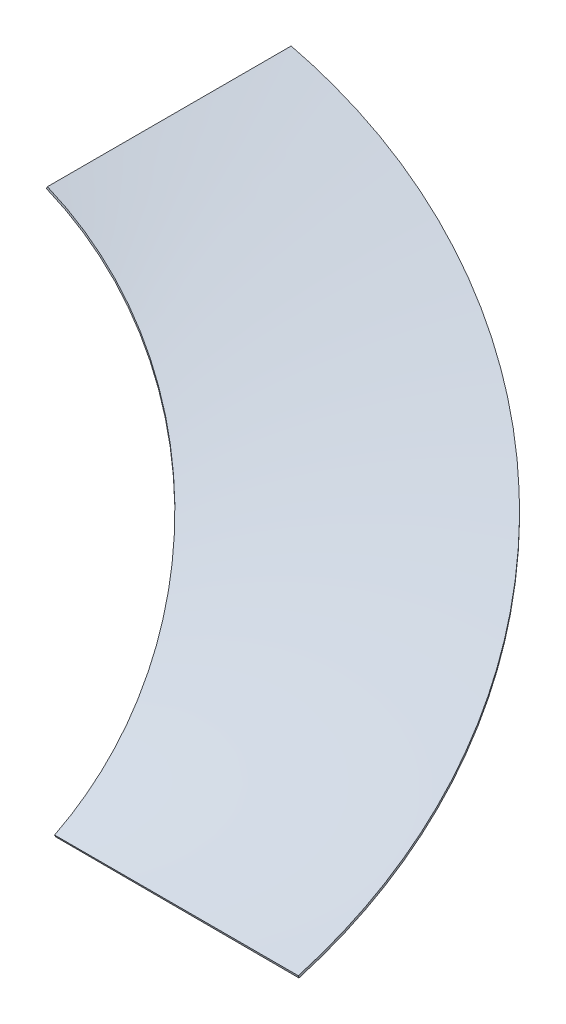
ISO-10303-21;
HEADER;
FILE_DESCRIPTION(('STEP AP214'),'2;1');
FILE_NAME('part.step','',(''),(''),'','','');
FILE_SCHEMA(('AUTOMOTIVE_DESIGN { 1 0 10303 214 1 1 1 1 }'));
ENDSEC;
DATA;
#1=APPLICATION_CONTEXT('core data for automotive mechanical design processes');
#2=APPLICATION_PROTOCOL_DEFINITION('international standard','automotive_design',2000,#1);
#3=PRODUCT_CONTEXT('',#1,'mechanical');
#4=PRODUCT('Part','Part','',(#3));
#5=PRODUCT_RELATED_PRODUCT_CATEGORY('part','',(#4));
#6=PRODUCT_DEFINITION_FORMATION('','',#4);
#7=PRODUCT_DEFINITION_CONTEXT('part definition',#1,'design');
#8=PRODUCT_DEFINITION('design','',#6,#7);
#9=PRODUCT_DEFINITION_SHAPE('','',#8);
#10=(LENGTH_UNIT() NAMED_UNIT(*) SI_UNIT(.MILLI.,.METRE.));
#11=(NAMED_UNIT(*) PLANE_ANGLE_UNIT() SI_UNIT($,.RADIAN.));
#12=(NAMED_UNIT(*) SI_UNIT($,.STERADIAN.) SOLID_ANGLE_UNIT());
#13=UNCERTAINTY_MEASURE_WITH_UNIT(LENGTH_MEASURE(1.E-05),#10,'distance_accuracy_value','');
#14=(GEOMETRIC_REPRESENTATION_CONTEXT(3) GLOBAL_UNCERTAINTY_ASSIGNED_CONTEXT((#13)) GLOBAL_UNIT_ASSIGNED_CONTEXT((#10,
#11,#12)) REPRESENTATION_CONTEXT('',''));
#15=CARTESIAN_POINT('',(0.,0.,0.));
#16=DIRECTION('',(0.,0.,1.));
#17=DIRECTION('',(1.,0.,0.));
#18=AXIS2_PLACEMENT_3D('',#15,#16,#17);
#19=CARTESIAN_POINT('',(-484.510247073434,645.049716333219,-1384.1755089846));
#20=CARTESIAN_POINT('',(-425.276618010289,630.717785401599,-1384.17550896828));
#21=CARTESIAN_POINT('',(-366.239828244707,614.964845352315,-1378.78392147312));
#22=CARTESIAN_POINT('',(-250.569571430583,581.149234139819,-1357.14027496421));
#23=CARTESIAN_POINT('',(-193.936685279515,563.08676452438,-1340.88531896048));
#24=CARTESIAN_POINT('',(-85.1408775732459,525.259805763091,-1297.83430630237));
#25=CARTESIAN_POINT('',(-32.9825014096547,505.496035399765,-1271.03616701259));
#26=CARTESIAN_POINT('',(64.8268372401466,464.932423457273,-1207.70017000333));
#27=CARTESIAN_POINT('',(110.471711357474,444.133352659898,-1171.16279254358));
#28=CARTESIAN_POINT('',(193.412905869404,402.200001742397,-1089.66238385116));
#29=CARTESIAN_POINT('',(230.703694170723,381.066518431024,-1044.70327012766));
#30=CARTESIAN_POINT('',(295.475365983642,339.176500249905,-948.121798327969));
#31=CARTESIAN_POINT('',(322.953559637321,318.420761378572,-896.505637693532));
#32=CARTESIAN_POINT('',(367.149681637812,277.985687454505,-788.662639227754));
#33=CARTESIAN_POINT('',(383.868375476254,258.307120743669,-732.441801589984));
#34=CARTESIAN_POINT('',(406.135224444985,220.689573763304,-617.539419442532));
#35=CARTESIAN_POINT('',(411.686291498294,202.750765056944,-558.859940091975));
#36=CARTESIAN_POINT('',(411.686291501015,185.985117133098,-500.));
#37=CARTESIAN_POINT('',(-485.450927627462,641.161899452851,-1384.1755089846));
#38=CARTESIAN_POINT('',(-426.278009225807,626.844657828996,-1384.23243821106));
#39=CARTESIAN_POINT('',(-367.290729370353,611.106466237392,-1378.90996340589));
#40=CARTESIAN_POINT('',(-251.690427350761,577.318768346373,-1357.42060147136));
#41=CARTESIAN_POINT('',(-195.077553617262,559.269347955813,-1341.25072236441));
#42=CARTESIAN_POINT('',(-86.2883243426591,521.465147117397,-1298.3743999458));
#43=CARTESIAN_POINT('',(-34.1163041996828,501.711021066972,-1271.66574563944));
#44=CARTESIAN_POINT('',(63.7529931091812,461.16212994421,-1208.50014320366));
#45=CARTESIAN_POINT('',(109.444278611392,440.368090899666,-1172.04352256486));
#46=CARTESIAN_POINT('',(192.504606309546,398.439645135084,-1090.68376019541));
#47=CARTESIAN_POINT('',(229.868172703384,377.305977772022,-1045.78434665336));
#48=CARTESIAN_POINT('',(294.800777798351,335.410470624478,-949.29245637602));
#49=CARTESIAN_POINT('',(322.367147679505,314.649358778007,-897.705982802977));
#50=CARTESIAN_POINT('',(366.741734089038,274.199039035033,-789.888631677298));
#51=CARTESIAN_POINT('',(383.550683039416,254.510561905792,-733.66366638601));
#52=CARTESIAN_POINT('',(405.987198937173,216.869857389619,-618.720773050599));
#53=CARTESIAN_POINT('',(411.617610619749,198.917844532825,-560.005084399784));
#54=CARTESIAN_POINT('',(411.686291501015,182.138133864403,-501.09577357624));
#55=B_SPLINE_SURFACE_WITH_KNOTS('',1,3,((#19,#20,#21,#22,#23,#24,#25,#26,#27,#28,#29,#30,#31,
#32,#33,#34,#35,#36),(#37,#38,#39,#40,#41,#42,#43,#44,#45,#46,#47,#48,#49,#50,#51,#52,#53,#54)),
.UNSPECIFIED.,.F.,.F.,.F.,(2,2),(4,2,2,2,2,2,2,2,4),(0.,1.),(0.,0.125,0.25,0.375,0.5,0.625,0.75,
0.875,1.),.UNSPECIFIED.);
#56=CARTESIAN_POINT('',(411.686291501015,182.138133864403,-501.09577357624));
#57=CARTESIAN_POINT('',(411.686291501015,185.985117133098,-500.));
#58=B_SPLINE_CURVE_WITH_KNOTS('',1,(#56,#57),.UNSPECIFIED.,.F.,.F.,(2,2),(0.,1.),.UNSPECIFIED.);
#59=CARTESIAN_POINT('',(411.686291501015,182.138133864403,-501.09577357624));
#60=VERTEX_POINT('',#59);
#61=CARTESIAN_POINT('',(411.686291501015,185.985117133098,-500.));
#62=VERTEX_POINT('',#61);
#63=EDGE_CURVE('E12',#60,#62,#58,.T.);
#64=CARTESIAN_POINT('',(411.686291501015,182.138133864403,-501.09577357624));
#65=CARTESIAN_POINT('',(411.617610619749,198.917844532825,-560.005084399784));
#66=CARTESIAN_POINT('',(405.987198937173,216.869857389619,-618.720773050599));
#67=CARTESIAN_POINT('',(383.550683039416,254.510561905792,-733.66366638601));
#68=CARTESIAN_POINT('',(366.741734089038,274.199039035033,-789.888631677298));
#69=CARTESIAN_POINT('',(322.367147679505,314.649358778007,-897.705982802977));
#70=CARTESIAN_POINT('',(294.800777798351,335.410470624478,-949.29245637602));
#71=CARTESIAN_POINT('',(229.868172703384,377.305977772022,-1045.78434665336));
#72=CARTESIAN_POINT('',(192.504606309546,398.439645135084,-1090.68376019541));
#73=CARTESIAN_POINT('',(109.444278611392,440.368090899666,-1172.04352256486));
#74=CARTESIAN_POINT('',(63.7529931091812,461.16212994421,-1208.50014320366));
#75=CARTESIAN_POINT('',(-34.1163041996828,501.711021066972,-1271.66574563944));
#76=CARTESIAN_POINT('',(-86.2883243426591,521.465147117397,-1298.3743999458));
#77=CARTESIAN_POINT('',(-195.077553617262,559.269347955813,-1341.25072236441));
#78=CARTESIAN_POINT('',(-251.690427350761,577.318768346373,-1357.42060147136));
#79=CARTESIAN_POINT('',(-367.290729370353,611.106466237392,-1378.90996340589));
#80=CARTESIAN_POINT('',(-426.278009225807,626.844657828996,-1384.23243821106));
#81=CARTESIAN_POINT('',(-485.450927627462,641.161899452851,-1384.1755089846));
#82=B_SPLINE_CURVE_WITH_KNOTS('',3,(#64,#65,#66,#67,#68,#69,#70,#71,#72,#73,#74,#75,#76,#77,#78,
#79,#80,#81),.UNSPECIFIED.,.F.,.F.,(4,2,2,2,2,2,2,2,4),(0.,0.125,0.25,0.375,0.5,0.625,0.75,
0.875,1.),.UNSPECIFIED.);
#83=CARTESIAN_POINT('',(-485.450927627462,641.161899452851,-1384.1755089846));
#84=VERTEX_POINT('',#83);
#85=EDGE_CURVE('E110',#60,#84,#82,.T.);
#86=CARTESIAN_POINT('',(-485.450927627462,641.161899452851,-1384.1755089846));
#87=CARTESIAN_POINT('',(-484.510247073434,645.049716333219,-1384.1755089846));
#88=B_SPLINE_CURVE_WITH_KNOTS('',1,(#86,#87),.UNSPECIFIED.,.F.,.F.,(2,2),(0.,1.),.UNSPECIFIED.);
#89=CARTESIAN_POINT('',(-484.510247073434,645.049716333219,-1384.1755089846));
#90=VERTEX_POINT('',#89);
#91=EDGE_CURVE('E58',#84,#90,#88,.T.);
#92=CARTESIAN_POINT('',(411.686291501015,185.985117133098,-500.));
#93=CARTESIAN_POINT('',(411.686291498294,202.750765056944,-558.859940091975));
#94=CARTESIAN_POINT('',(406.135224444985,220.689573763304,-617.539419442533));
#95=CARTESIAN_POINT('',(383.868375476254,258.307120743669,-732.441801589984));
#96=CARTESIAN_POINT('',(367.149681637811,277.985687454505,-788.662639227754));
#97=CARTESIAN_POINT('',(322.95355963732,318.420761378572,-896.505637693532));
#98=CARTESIAN_POINT('',(295.475365983642,339.176500249905,-948.121798327969));
#99=CARTESIAN_POINT('',(230.703694170723,381.066518431024,-1044.70327012766));
#100=CARTESIAN_POINT('',(193.412905869404,402.200001742397,-1089.66238385116));
#101=CARTESIAN_POINT('',(110.471711357474,444.133352659898,-1171.16279254358));
#102=CARTESIAN_POINT('',(64.8268372401466,464.932423457273,-1207.70017000333));
#103=CARTESIAN_POINT('',(-32.9825014096547,505.496035399765,-1271.03616701259));
#104=CARTESIAN_POINT('',(-85.1408775732459,525.259805763091,-1297.83430630237));
#105=CARTESIAN_POINT('',(-193.936685279515,563.08676452438,-1340.88531896048));
#106=CARTESIAN_POINT('',(-250.569571430583,581.149234139819,-1357.14027496421));
#107=CARTESIAN_POINT('',(-366.239828244707,614.964845352315,-1378.78392147312));
#108=CARTESIAN_POINT('',(-425.276618010289,630.717785401599,-1384.17550896828));
#109=CARTESIAN_POINT('',(-484.510247073434,645.049716333219,-1384.1755089846));
#110=B_SPLINE_CURVE_WITH_KNOTS('',3,(#92,#93,#94,#95,#96,#97,#98,#99,#100,#101,#102,#103,#104,
#105,#106,#107,#108,#109),.UNSPECIFIED.,.F.,.F.,(4,2,2,2,2,2,2,2,4),(0.,0.125,0.25,0.375,0.5,
0.625,0.75,0.875,1.),.UNSPECIFIED.);
#111=EDGE_CURVE('E245',#62,#90,#110,.T.);
#112=ORIENTED_EDGE('',*,*,#63,.F.);
#113=ORIENTED_EDGE('',*,*,#85,.T.);
#114=ORIENTED_EDGE('',*,*,#91,.T.);
#115=ORIENTED_EDGE('',*,*,#111,.F.);
#116=EDGE_LOOP('',(#112,#113,#114,#115));
#117=FACE_BOUND('',#116,.T.);
#118=ADVANCED_FACE('F44',(#117),#55,.F.);
#119=CARTESIAN_POINT('',(-484.510247073434,645.049716333219,-1384.1755089846));
#120=CARTESIAN_POINT('',(-484.510247073434,645.049716333219,-1316.1134118176));
#121=CARTESIAN_POINT('',(-484.510247073434,645.049716333219,-1248.05131465059));
#122=CARTESIAN_POINT('',(-484.510247073434,645.049716333218,-1111.92712031658));
#123=CARTESIAN_POINT('',(-484.510247073434,645.049716333218,-1043.86502314958));
#124=CARTESIAN_POINT('',(-484.510247073434,645.049716333218,-975.802925982574));
#125=CARTESIAN_POINT('',(-485.450927627462,641.161899452851,-1384.1755089846));
#126=CARTESIAN_POINT('',(-485.512724148625,641.176851490859,-1316.11341156927));
#127=CARTESIAN_POINT('',(-485.585777729269,641.195771660561,-1248.05131465059));
#128=CARTESIAN_POINT('',(-485.773717385591,641.253231313909,-1111.92712031658));
#129=CARTESIAN_POINT('',(-485.887892538979,641.290640995127,-1043.86502112852));
#130=CARTESIAN_POINT('',(-486.043958053431,641.355432826253,-975.802925982574));
#131=B_SPLINE_SURFACE_WITH_KNOTS('',1,3,((#119,#120,#121,#122,#123,#124),(#125,#126,#127,#128,
#129,#130)),.UNSPECIFIED.,.F.,.F.,.F.,(2,2),(4,2,4),(0.,1.),(-0.204186291501015,0.,
0.204186291501015),.UNSPECIFIED.);
#132=CARTESIAN_POINT('',(-485.450927627462,641.161899452851,-1384.1755089846));
#133=CARTESIAN_POINT('',(-485.512724148625,641.176851490859,-1316.11341156927));
#134=CARTESIAN_POINT('',(-485.585777729269,641.195771660561,-1248.05131465059));
#135=CARTESIAN_POINT('',(-485.773717385591,641.253231313909,-1111.92712031658));
#136=CARTESIAN_POINT('',(-485.887892538979,641.290640995127,-1043.86502112852));
#137=CARTESIAN_POINT('',(-486.043958053431,641.355432826253,-975.802925982574));
#138=B_SPLINE_CURVE_WITH_KNOTS('',3,(#132,#133,#134,#135,#136,#137),.UNSPECIFIED.,.F.,.F.,(4,2,
4),(-0.204186291501015,0.,0.204186291501015),.UNSPECIFIED.);
#139=CARTESIAN_POINT('',(-486.043958053431,641.355432826253,-975.802925982574));
#140=VERTEX_POINT('',#139);
#141=EDGE_CURVE('E278',#84,#140,#138,.T.);
#142=CARTESIAN_POINT('',(-486.043958053431,641.355432826253,-975.802925982574));
#143=CARTESIAN_POINT('',(-484.510247073434,645.049716333218,-975.802925982574));
#144=B_SPLINE_CURVE_WITH_KNOTS('',1,(#142,#143),.UNSPECIFIED.,.F.,.F.,(2,2),(0.,1.),.UNSPECIFIED.);
#145=CARTESIAN_POINT('',(-484.510247073434,645.049716333218,-975.802925982574));
#146=VERTEX_POINT('',#145);
#147=EDGE_CURVE('E100',#140,#146,#144,.T.);
#148=CARTESIAN_POINT('',(-484.510247073434,645.049716333219,-1384.1755089846));
#149=CARTESIAN_POINT('',(-484.510247073434,645.049716333219,-1248.05131465059));
#150=CARTESIAN_POINT('',(-484.510247073434,645.049716333219,-1111.92712031658));
#151=CARTESIAN_POINT('',(-484.510247073434,645.049716333218,-975.802925982574));
#152=B_SPLINE_CURVE_WITH_KNOTS('',3,(#148,#149,#150,#151),.UNSPECIFIED.,.F.,.F.,(4,4),(0.,1.),.UNSPECIFIED.);
#153=EDGE_CURVE('E118',#90,#146,#152,.T.);
#154=ORIENTED_EDGE('',*,*,#91,.F.);
#155=ORIENTED_EDGE('',*,*,#141,.T.);
#156=ORIENTED_EDGE('',*,*,#147,.T.);
#157=ORIENTED_EDGE('',*,*,#153,.F.);
#158=EDGE_LOOP('',(#154,#155,#156,#157));
#159=FACE_BOUND('',#158,.T.);
#160=ADVANCED_FACE('F141',(#159),#131,.T.);
#161=CARTESIAN_POINT('',(-484.510247073434,645.049716333218,-975.802925982574));
#162=CARTESIAN_POINT('',(-449.98526168273,630.716395926671,-975.802925968967));
#163=CARTESIAN_POINT('',(-416.13466179406,614.964845352314,-972.659936656422));
#164=CARTESIAN_POINT('',(-350.892955099552,581.149234139819,-960.452231092525));
#165=CARTESIAN_POINT('',(-319.505166969869,563.08676452438,-951.391055097783));
#166=CARTESIAN_POINT('',(-260.089731212656,525.259805763091,-927.880087806124));
#167=CARTESIAN_POINT('',(-232.06073455837,505.496035399765,-913.433643955195));
#168=CARTESIAN_POINT('',(-180.027939011468,464.932423457273,-879.740041397317));
#169=CARTESIAN_POINT('',(-156.020899035803,444.133352659898,-860.494246175378));
#170=CARTESIAN_POINT('',(-112.538454769171,402.200001742397,-817.767142964874));
#171=CARTESIAN_POINT('',(-93.0599206851292,381.066518431024,-794.284278051489));
#172=CARTESIAN_POINT('',(-59.086677942815,339.176500249905,-743.626549223954));
#173=CARTESIAN_POINT('',(-44.5911557918889,318.420761378572,-716.448285744831));
#174=CARTESIAN_POINT('',(-21.0485975206975,277.985687454505,-659.002067377091));
#175=CARTESIAN_POINT('',(-12.0036140770698,258.307120743669,-628.73125310326));
#176=CARTESIAN_POINT('',(0.179322212748084,220.689573763304,-565.864324622919));
#177=CARTESIAN_POINT('',(3.31370849629526,202.752442282236,-533.269866060412));
#178=CARTESIAN_POINT('',(3.31370849898477,185.985117133098,-500.));
#179=CARTESIAN_POINT('',(-486.043958053431,641.355432826253,-975.802925982574));
#180=CARTESIAN_POINT('',(-451.622356411517,627.06503299967,-975.895735810364));
#181=CARTESIAN_POINT('',(-417.856938389391,611.35744451034,-972.866161255891));
#182=CARTESIAN_POINT('',(-352.740339802507,577.628424976245,-960.913943864619));
#183=CARTESIAN_POINT('',(-321.389879218012,559.607276817306,-951.994356464107));
#184=CARTESIAN_POINT('',(-261.994468623649,521.855140516419,-928.776289487581));
#185=CARTESIAN_POINT('',(-233.946172888402,502.123630506905,-914.480321528547));
#186=CARTESIAN_POINT('',(-181.819360515368,461.610662615898,-881.074297860059));
#187=CARTESIAN_POINT('',(-157.736553766217,440.829155276592,-861.964829231329));
#188=CARTESIAN_POINT('',(-114.056687833047,398.912983746171,-819.474271279481));
#189=CARTESIAN_POINT('',(-94.4564833879085,377.779036063119,-796.091451463447));
#190=CARTESIAN_POINT('',(-60.2126959768134,335.86942589068,-745.580812771338));
#191=CARTESIAN_POINT('',(-45.5689859981912,315.095268685404,-718.450399046845));
#192=CARTESIAN_POINT('',(-21.7264187430731,274.607631157705,-661.039910669623));
#193=CARTESIAN_POINT('',(-12.5304457920133,254.896155296883,-630.758731943464));
#194=CARTESIAN_POINT('',(-0.064753647935868,217.20266643616,-567.814917263285));
#195=CARTESIAN_POINT('',(3.20088566972068,199.223909088026,-535.156339910523));
#196=CARTESIAN_POINT('',(3.31370849898477,182.413112129912,-501.800216725069));
#197=B_SPLINE_SURFACE_WITH_KNOTS('',1,3,((#161,#162,#163,#164,#165,#166,#167,#168,#169,#170,
#171,#172,#173,#174,#175,#176,#177,#178),(#179,#180,#181,#182,#183,#184,#185,#186,#187,#188,
#189,#190,#191,#192,#193,#194,#195,#196)),.UNSPECIFIED.,.F.,.F.,.F.,(2,2),(4,2,2,2,2,2,2,2,4),
(0.,1.),(0.,0.125,0.25,0.375,0.5,0.625,0.75,0.875,1.),.UNSPECIFIED.);
#198=CARTESIAN_POINT('',(-486.043958053431,641.355432826253,-975.802925982574));
#199=CARTESIAN_POINT('',(-451.622356411517,627.06503299967,-975.895735810364));
#200=CARTESIAN_POINT('',(-417.856938389391,611.35744451034,-972.866161255891));
#201=CARTESIAN_POINT('',(-352.740339802507,577.628424976245,-960.913943864619));
#202=CARTESIAN_POINT('',(-321.389879218012,559.607276817306,-951.994356464107));
#203=CARTESIAN_POINT('',(-261.994468623649,521.855140516419,-928.776289487581));
#204=CARTESIAN_POINT('',(-233.946172888402,502.123630506905,-914.480321528547));
#205=CARTESIAN_POINT('',(-181.819360515368,461.610662615898,-881.074297860059));
#206=CARTESIAN_POINT('',(-157.736553766217,440.829155276592,-861.964829231329));
#207=CARTESIAN_POINT('',(-114.056687833047,398.912983746171,-819.474271279481));
#208=CARTESIAN_POINT('',(-94.4564833879085,377.779036063119,-796.091451463447));
#209=CARTESIAN_POINT('',(-60.2126959768134,335.86942589068,-745.580812771338));
#210=CARTESIAN_POINT('',(-45.5689859981912,315.095268685404,-718.450399046845));
#211=CARTESIAN_POINT('',(-21.7264187430731,274.607631157705,-661.039910669623));
#212=CARTESIAN_POINT('',(-12.5304457920133,254.896155296883,-630.758731943464));
#213=CARTESIAN_POINT('',(-0.064753647935868,217.20266643616,-567.814917263285));
#214=CARTESIAN_POINT('',(3.20088566972068,199.223909088026,-535.156339910523));
#215=CARTESIAN_POINT('',(3.31370849898477,182.413112129912,-501.800216725069));
#216=B_SPLINE_CURVE_WITH_KNOTS('',3,(#198,#199,#200,#201,#202,#203,#204,#205,#206,#207,#208,
#209,#210,#211,#212,#213,#214,#215),.UNSPECIFIED.,.F.,.F.,(4,2,2,2,2,2,2,2,4),(0.,0.125,0.25,
0.375,0.5,0.625,0.75,0.875,1.),.UNSPECIFIED.);
#217=CARTESIAN_POINT('',(3.31370870317106,182.413112129634,-501.800216724517));
#218=VERTEX_POINT('',#217);
#219=EDGE_CURVE('E108',#140,#218,#216,.T.);
#220=CARTESIAN_POINT('',(3.31370849898477,182.413112129912,-501.800216725069));
#221=CARTESIAN_POINT('',(3.31370849898477,185.985117133098,-500.));
#222=B_SPLINE_CURVE_WITH_KNOTS('',1,(#220,#221),.UNSPECIFIED.,.F.,.F.,(2,2),(0.,1.),.UNSPECIFIED.);
#223=CARTESIAN_POINT('',(3.31370849898477,185.985117133098,-500.));
#224=VERTEX_POINT('',#223);
#225=EDGE_CURVE('E88',#218,#224,#222,.T.);
#226=CARTESIAN_POINT('',(-484.510247073434,645.049716333218,-975.802925982574));
#227=CARTESIAN_POINT('',(-449.98526168273,630.716395926671,-975.802925968967));
#228=CARTESIAN_POINT('',(-416.13466179406,614.964845352314,-972.659936656422));
#229=CARTESIAN_POINT('',(-350.892955099552,581.149234139819,-960.452231092525));
#230=CARTESIAN_POINT('',(-319.505166969869,563.08676452438,-951.391055097783));
#231=CARTESIAN_POINT('',(-260.089731212656,525.259805763091,-927.880087806124));
#232=CARTESIAN_POINT('',(-232.06073455837,505.496035399765,-913.433643955195));
#233=CARTESIAN_POINT('',(-180.027939011468,464.932423457273,-879.740041397317));
#234=CARTESIAN_POINT('',(-156.020899035803,444.133352659898,-860.494246175378));
#235=CARTESIAN_POINT('',(-112.538454769171,402.200001742397,-817.767142964874));
#236=CARTESIAN_POINT('',(-93.0599206851292,381.066518431024,-794.284278051489));
#237=CARTESIAN_POINT('',(-59.086677942815,339.176500249905,-743.626549223954));
#238=CARTESIAN_POINT('',(-44.591155791889,318.420761378572,-716.448285744831));
#239=CARTESIAN_POINT('',(-21.0485975206975,277.985687454505,-659.002067377091));
#240=CARTESIAN_POINT('',(-12.0036140770698,258.307120743669,-628.731253103261));
#241=CARTESIAN_POINT('',(0.179322212748072,220.689573763304,-565.864324622919));
#242=CARTESIAN_POINT('',(3.31370849629526,202.752442282236,-533.269866060412));
#243=CARTESIAN_POINT('',(3.31370849898477,185.985117133098,-500.));
#244=B_SPLINE_CURVE_WITH_KNOTS('',3,(#226,#227,#228,#229,#230,#231,#232,#233,#234,#235,#236,
#237,#238,#239,#240,#241,#242,#243),.UNSPECIFIED.,.F.,.F.,(4,2,2,2,2,2,2,2,4),(0.,0.125,0.25,
0.375,0.5,0.625,0.75,0.875,1.),.UNSPECIFIED.);
#245=EDGE_CURVE('E101',#146,#224,#244,.T.);
#246=ORIENTED_EDGE('',*,*,#147,.F.);
#247=ORIENTED_EDGE('',*,*,#219,.T.);
#248=ORIENTED_EDGE('',*,*,#225,.T.);
#249=ORIENTED_EDGE('',*,*,#245,.F.);
#250=EDGE_LOOP('',(#246,#247,#248,#249));
#251=FACE_BOUND('',#250,.T.);
#252=ADVANCED_FACE('F115',(#251),#197,.T.);
#253=CARTESIAN_POINT('',(3.31370849898477,185.985117133098,-500.));
#254=CARTESIAN_POINT('',(71.3758056659898,185.985117133098,-500.));
#255=CARTESIAN_POINT('',(139.437902832995,185.985117133098,-500.));
#256=CARTESIAN_POINT('',(275.562097167005,185.985117133098,-500.));
#257=CARTESIAN_POINT('',(343.62419433401,185.985117133098,-500.));
#258=CARTESIAN_POINT('',(411.686291501015,185.985117133098,-500.));
#259=CARTESIAN_POINT('',(3.31370849898477,182.413112129912,-501.800216725069));
#260=CARTESIAN_POINT('',(71.375802837561,182.320350716449,-501.616158756726));
#261=CARTESIAN_POINT('',(139.437902832995,182.267070855117,-501.479967852819));
#262=CARTESIAN_POINT('',(275.562097167005,182.185634664183,-501.256226866055));
#263=CARTESIAN_POINT('',(343.624193974162,182.159057751149,-501.169232038801));
#264=CARTESIAN_POINT('',(411.686291501015,182.138133864403,-501.09577357624));
#265=B_SPLINE_SURFACE_WITH_KNOTS('',1,3,((#253,#254,#255,#256,#257,#258),(#259,#260,#261,#262,
#263,#264)),.UNSPECIFIED.,.F.,.F.,.F.,(2,2),(4,2,4),(0.,1.),(-0.204186291501015,0.,
0.204186291501015),.UNSPECIFIED.);
#266=CARTESIAN_POINT('',(3.31370849898477,182.413112129912,-501.800216725069));
#267=CARTESIAN_POINT('',(71.375802837561,182.320350716449,-501.616158756726));
#268=CARTESIAN_POINT('',(139.437902832995,182.267070855117,-501.479967852819));
#269=CARTESIAN_POINT('',(275.562097167005,182.185634664183,-501.256226866055));
#270=CARTESIAN_POINT('',(343.624193974162,182.159057751149,-501.169232038801));
#271=CARTESIAN_POINT('',(411.686291501015,182.138133864403,-501.09577357624));
#272=B_SPLINE_CURVE_WITH_KNOTS('',3,(#266,#267,#268,#269,#270,#271),.UNSPECIFIED.,.F.,.F.,(4,2,
4),(-0.204186291501015,0.,0.204186291501015),.UNSPECIFIED.);
#273=EDGE_CURVE('E90',#218,#60,#272,.T.);
#274=CARTESIAN_POINT('',(3.31370849898477,185.985117133098,-500.));
#275=CARTESIAN_POINT('',(139.437902832995,185.985117133098,-500.));
#276=CARTESIAN_POINT('',(275.562097167005,185.985117133098,-500.));
#277=CARTESIAN_POINT('',(411.686291501015,185.985117133098,-500.));
#278=B_SPLINE_CURVE_WITH_KNOTS('',3,(#274,#275,#276,#277),.UNSPECIFIED.,.F.,.F.,(4,4),(0.,1.),.UNSPECIFIED.);
#279=EDGE_CURVE('E93',#224,#62,#278,.T.);
#280=ORIENTED_EDGE('',*,*,#273,.T.);
#281=ORIENTED_EDGE('',*,*,#63,.T.);
#282=ORIENTED_EDGE('',*,*,#279,.F.);
#283=ORIENTED_EDGE('',*,*,#225,.F.);
#284=EDGE_LOOP('',(#280,#281,#282,#283));
#285=FACE_BOUND('',#284,.T.);
#286=ADVANCED_FACE('F46',(#285),#265,.T.);
#287=CARTESIAN_POINT('',(-484.510247073434,645.049716333218,-975.802925982574));
#288=CARTESIAN_POINT('',(-484.510247073434,645.049716333219,-1111.92712031658));
#289=CARTESIAN_POINT('',(-484.510247073434,645.049716333219,-1248.05131465059));
#290=CARTESIAN_POINT('',(-484.510247073434,645.049716333219,-1384.1755089846));
#291=CARTESIAN_POINT('',(-449.98526168273,630.716395926671,-975.802925968967));
#292=CARTESIAN_POINT('',(-441.749047125249,630.71685908498,-1111.92712030207));
#293=CARTESIAN_POINT('',(-433.512832567769,630.71732224329,-1248.05131463517));
#294=CARTESIAN_POINT('',(-425.276618010289,630.717785401599,-1384.17550896828));
#295=CARTESIAN_POINT('',(-416.13466179406,614.964845352314,-972.659936656422));
#296=CARTESIAN_POINT('',(-399.503050610942,614.964845352315,-1108.03459826199));
#297=CARTESIAN_POINT('',(-382.871439427825,614.964845352315,-1243.40925986755));
#298=CARTESIAN_POINT('',(-366.239828244707,614.964845352315,-1378.78392147312));
#299=CARTESIAN_POINT('',(-350.892955099552,581.149234139819,-960.452231092525));
#300=CARTESIAN_POINT('',(-317.451827209896,581.149234139819,-1092.68157904975));
#301=CARTESIAN_POINT('',(-284.010699320239,581.149234139819,-1224.91092700698));
#302=CARTESIAN_POINT('',(-250.569571430583,581.149234139819,-1357.14027496421));
#303=CARTESIAN_POINT('',(-319.505166969869,563.08676452438,-951.391055097783));
#304=CARTESIAN_POINT('',(-277.649006406418,563.08676452438,-1081.22247638535));
#305=CARTESIAN_POINT('',(-235.792845842966,563.08676452438,-1211.05389767291));
#306=CARTESIAN_POINT('',(-193.936685279515,563.08676452438,-1340.88531896048));
#307=CARTESIAN_POINT('',(-260.089731212656,525.259805763091,-927.880087806124));
#308=CARTESIAN_POINT('',(-201.773446666186,525.259805763091,-1051.19816063821));
#309=CARTESIAN_POINT('',(-143.457162119716,525.259805763091,-1174.51623347029));
#310=CARTESIAN_POINT('',(-85.1408775732459,525.259805763091,-1297.83430630237));
#311=CARTESIAN_POINT('',(-232.06073455837,505.496035399765,-913.433643955195));
#312=CARTESIAN_POINT('',(-165.701323508798,505.496035399765,-1032.63448497433));
#313=CARTESIAN_POINT('',(-99.3419124592266,505.496035399765,-1151.83532599346));
#314=CARTESIAN_POINT('',(-32.9825014096547,505.496035399765,-1271.03616701259));
#315=CARTESIAN_POINT('',(-180.027939011468,464.932423457273,-879.740041397317));
#316=CARTESIAN_POINT('',(-98.4096802609301,464.932423457273,-989.060084265988));
#317=CARTESIAN_POINT('',(-16.7914215103917,464.932423457273,-1098.38012713466));
#318=CARTESIAN_POINT('',(64.8268372401466,464.932423457273,-1207.70017000333));
#319=CARTESIAN_POINT('',(-156.020899035803,444.133352659898,-860.494246175378));
#320=CARTESIAN_POINT('',(-67.1900289047109,444.133352659898,-964.050428298111));
#321=CARTESIAN_POINT('',(21.6408412263817,444.133352659898,-1067.60661042084));
#322=CARTESIAN_POINT('',(110.471711357474,444.133352659898,-1171.16279254358));
#323=CARTESIAN_POINT('',(-112.538454769171,402.200001742397,-817.767142964874));
#324=CARTESIAN_POINT('',(-10.5546678896463,402.200001742397,-908.398889926969));
#325=CARTESIAN_POINT('',(91.4291189898787,402.200001742397,-999.030636889064));
#326=CARTESIAN_POINT('',(193.412905869404,402.200001742397,-1089.66238385116));
#327=CARTESIAN_POINT('',(-93.0599206851292,381.066518431024,-794.284278051489));
#328=CARTESIAN_POINT('',(14.8612842668215,381.066518431024,-877.757275410214));
#329=CARTESIAN_POINT('',(122.782489218772,381.066518431024,-961.230272768939));
#330=CARTESIAN_POINT('',(230.703694170723,381.066518431024,-1044.70327012766));
#331=CARTESIAN_POINT('',(-59.086677942815,339.176500249905,-743.626549223954));
#332=CARTESIAN_POINT('',(59.1006700326707,339.176500249905,-811.791632258626));
#333=CARTESIAN_POINT('',(177.288018008156,339.176500249905,-879.956715293297));
#334=CARTESIAN_POINT('',(295.475365983642,339.176500249905,-948.121798327969));
#335=CARTESIAN_POINT('',(-44.591155791889,318.420761378572,-716.448285744831));
#336=CARTESIAN_POINT('',(77.9237493511808,318.420761378572,-776.467403061064));
#337=CARTESIAN_POINT('',(200.438654494251,318.420761378572,-836.486520377298));
#338=CARTESIAN_POINT('',(322.95355963732,318.420761378572,-896.505637693532));
#339=CARTESIAN_POINT('',(-21.0485975206975,277.985687454505,-659.002067377091));
#340=CARTESIAN_POINT('',(108.350828865472,277.985687454505,-702.222257993979));
#341=CARTESIAN_POINT('',(237.750255251642,277.985687454505,-745.442448610866));
#342=CARTESIAN_POINT('',(367.149681637811,277.985687454505,-788.662639227754));
#343=CARTESIAN_POINT('',(-12.0036140770698,258.307120743669,-628.731253103261));
#344=CARTESIAN_POINT('',(119.953715774038,258.307120743669,-663.301435932168));
#345=CARTESIAN_POINT('',(251.911045625146,258.307120743669,-697.871618761076));
#346=CARTESIAN_POINT('',(383.868375476254,258.307120743669,-732.441801589984));
#347=CARTESIAN_POINT('',(0.179322212748072,220.689573763304,-565.864324622919));
#348=CARTESIAN_POINT('',(135.49795629016,220.689573763304,-583.089356229457));
#349=CARTESIAN_POINT('',(270.816590367572,220.689573763304,-600.314387835995));
#350=CARTESIAN_POINT('',(406.135224444985,220.689573763304,-617.539419442533));
#351=CARTESIAN_POINT('',(3.31370849629526,202.752442282236,-533.269866060412));
#352=CARTESIAN_POINT('',(139.437902830295,202.751883207139,-541.7998907376));
#353=CARTESIAN_POINT('',(275.562097164294,202.751324132042,-550.329915414787));
#354=CARTESIAN_POINT('',(411.686291498294,202.750765056944,-558.859940091975));
#355=CARTESIAN_POINT('',(3.31370849898477,185.985117133098,-500.));
#356=CARTESIAN_POINT('',(139.437902832995,185.985117133098,-500.));
#357=CARTESIAN_POINT('',(275.562097167005,185.985117133098,-500.));
#358=CARTESIAN_POINT('',(411.686291501015,185.985117133098,-500.));
#359=B_SPLINE_SURFACE_WITH_KNOTS('',3,3,((#287,#288,#289,#290),(#291,#292,#293,#294),(#295,#296,
#297,#298),(#299,#300,#301,#302),(#303,#304,#305,#306),(#307,#308,#309,#310),(#311,#312,#313,
#314),(#315,#316,#317,#318),(#319,#320,#321,#322),(#323,#324,#325,#326),(#327,#328,#329,#330),
(#331,#332,#333,#334),(#335,#336,#337,#338),(#339,#340,#341,#342),(#343,#344,#345,#346),(#347,
#348,#349,#350),(#351,#352,#353,#354),(#355,#356,#357,#358)),.UNSPECIFIED.,.F.,.F.,.F.,(4,2,2,2,
2,2,2,2,4),(4,4),(0.,0.125,0.25,0.375,0.5,0.625,0.75,0.875,1.),(0.,1.),.UNSPECIFIED.);
#360=ORIENTED_EDGE('',*,*,#245,.T.);
#361=ORIENTED_EDGE('',*,*,#279,.T.);
#362=ORIENTED_EDGE('',*,*,#111,.T.);
#363=ORIENTED_EDGE('',*,*,#153,.T.);
#364=EDGE_LOOP('',(#360,#361,#362,#363));
#365=FACE_BOUND('',#364,.T.);
#366=ADVANCED_FACE('F204',(#365),#359,.T.);
#367=CARTESIAN_POINT('',(-484.510247073434,645.049716333218,-975.802925982574));
#368=CARTESIAN_POINT('',(-484.510247073434,645.049716333219,-1111.92712031658));
#369=CARTESIAN_POINT('',(-484.510247073434,645.049716333219,-1248.05131465059));
#370=CARTESIAN_POINT('',(-484.510247073434,645.049716333219,-1384.1755089846));
#371=CARTESIAN_POINT('',(-449.98526168273,630.716395926671,-975.802925968967));
#372=CARTESIAN_POINT('',(-441.749047125249,630.71685908498,-1111.92712030207));
#373=CARTESIAN_POINT('',(-433.512832567769,630.71732224329,-1248.05131463517));
#374=CARTESIAN_POINT('',(-425.276618010289,630.717785401599,-1384.17550896828));
#375=CARTESIAN_POINT('',(-416.13466179406,614.964845352314,-972.659936656422));
#376=CARTESIAN_POINT('',(-399.503050610942,614.964845352315,-1108.03459826199));
#377=CARTESIAN_POINT('',(-382.871439427825,614.964845352315,-1243.40925986755));
#378=CARTESIAN_POINT('',(-366.239828244707,614.964845352315,-1378.78392147312));
#379=CARTESIAN_POINT('',(-350.892955099552,581.149234139819,-960.452231092525));
#380=CARTESIAN_POINT('',(-317.451827209896,581.149234139819,-1092.68157904975));
#381=CARTESIAN_POINT('',(-284.010699320239,581.149234139819,-1224.91092700698));
#382=CARTESIAN_POINT('',(-250.569571430583,581.149234139819,-1357.14027496421));
#383=CARTESIAN_POINT('',(-319.505166969869,563.08676452438,-951.391055097783));
#384=CARTESIAN_POINT('',(-277.649006406418,563.08676452438,-1081.22247638535));
#385=CARTESIAN_POINT('',(-235.792845842966,563.08676452438,-1211.05389767291));
#386=CARTESIAN_POINT('',(-193.936685279515,563.08676452438,-1340.88531896048));
#387=CARTESIAN_POINT('',(-260.089731212656,525.259805763091,-927.880087806124));
#388=CARTESIAN_POINT('',(-201.773446666186,525.259805763091,-1051.19816063821));
#389=CARTESIAN_POINT('',(-143.457162119716,525.259805763091,-1174.51623347029));
#390=CARTESIAN_POINT('',(-85.1408775732459,525.259805763091,-1297.83430630237));
#391=CARTESIAN_POINT('',(-232.06073455837,505.496035399765,-913.433643955195));
#392=CARTESIAN_POINT('',(-165.701323508798,505.496035399765,-1032.63448497433));
#393=CARTESIAN_POINT('',(-99.3419124592266,505.496035399765,-1151.83532599346));
#394=CARTESIAN_POINT('',(-32.9825014096547,505.496035399765,-1271.03616701259));
#395=CARTESIAN_POINT('',(-180.027939011468,464.932423457273,-879.740041397317));
#396=CARTESIAN_POINT('',(-98.4096802609301,464.932423457273,-989.060084265988));
#397=CARTESIAN_POINT('',(-16.7914215103917,464.932423457273,-1098.38012713466));
#398=CARTESIAN_POINT('',(64.8268372401466,464.932423457273,-1207.70017000333));
#399=CARTESIAN_POINT('',(-156.020899035803,444.133352659898,-860.494246175378));
#400=CARTESIAN_POINT('',(-67.1900289047109,444.133352659898,-964.050428298111));
#401=CARTESIAN_POINT('',(21.6408412263817,444.133352659898,-1067.60661042084));
#402=CARTESIAN_POINT('',(110.471711357474,444.133352659898,-1171.16279254358));
#403=CARTESIAN_POINT('',(-112.538454769171,402.200001742397,-817.767142964874));
#404=CARTESIAN_POINT('',(-10.5546678896463,402.200001742397,-908.398889926969));
#405=CARTESIAN_POINT('',(91.4291189898787,402.200001742397,-999.030636889064));
#406=CARTESIAN_POINT('',(193.412905869404,402.200001742397,-1089.66238385116));
#407=CARTESIAN_POINT('',(-93.0599206851292,381.066518431024,-794.284278051489));
#408=CARTESIAN_POINT('',(14.8612842668215,381.066518431024,-877.757275410214));
#409=CARTESIAN_POINT('',(122.782489218772,381.066518431024,-961.230272768939));
#410=CARTESIAN_POINT('',(230.703694170723,381.066518431024,-1044.70327012766));
#411=CARTESIAN_POINT('',(-59.086677942815,339.176500249905,-743.626549223954));
#412=CARTESIAN_POINT('',(59.1006700326707,339.176500249905,-811.791632258626));
#413=CARTESIAN_POINT('',(177.288018008156,339.176500249905,-879.956715293297));
#414=CARTESIAN_POINT('',(295.475365983642,339.176500249905,-948.121798327969));
#415=CARTESIAN_POINT('',(-44.591155791889,318.420761378572,-716.448285744831));
#416=CARTESIAN_POINT('',(77.9237493511808,318.420761378572,-776.467403061064));
#417=CARTESIAN_POINT('',(200.438654494251,318.420761378572,-836.486520377298));
#418=CARTESIAN_POINT('',(322.95355963732,318.420761378572,-896.505637693532));
#419=CARTESIAN_POINT('',(-21.0485975206975,277.985687454505,-659.002067377091));
#420=CARTESIAN_POINT('',(108.350828865472,277.985687454505,-702.222257993979));
#421=CARTESIAN_POINT('',(237.750255251642,277.985687454505,-745.442448610866));
#422=CARTESIAN_POINT('',(367.149681637811,277.985687454505,-788.662639227754));
#423=CARTESIAN_POINT('',(-12.0036140770698,258.307120743669,-628.731253103261));
#424=CARTESIAN_POINT('',(119.953715774038,258.307120743669,-663.301435932168));
#425=CARTESIAN_POINT('',(251.911045625146,258.307120743669,-697.871618761076));
#426=CARTESIAN_POINT('',(383.868375476254,258.307120743669,-732.441801589984));
#427=CARTESIAN_POINT('',(0.179322212748072,220.689573763304,-565.864324622919));
#428=CARTESIAN_POINT('',(135.49795629016,220.689573763304,-583.089356229457));
#429=CARTESIAN_POINT('',(270.816590367572,220.689573763304,-600.314387835995));
#430=CARTESIAN_POINT('',(406.135224444985,220.689573763304,-617.539419442533));
#431=CARTESIAN_POINT('',(3.31370849629526,202.752442282236,-533.269866060412));
#432=CARTESIAN_POINT('',(139.437902830295,202.751883207139,-541.7998907376));
#433=CARTESIAN_POINT('',(275.562097164294,202.751324132042,-550.329915414787));
#434=CARTESIAN_POINT('',(411.686291498294,202.750765056944,-558.859940091975));
#435=CARTESIAN_POINT('',(3.31370849898477,185.985117133098,-500.));
#436=CARTESIAN_POINT('',(139.437902832995,185.985117133098,-500.));
#437=CARTESIAN_POINT('',(275.562097167005,185.985117133098,-500.));
#438=CARTESIAN_POINT('',(411.686291501015,185.985117133098,-500.));
#439=B_SPLINE_SURFACE_WITH_KNOTS('',3,3,((#367,#368,#369,#370),(#371,#372,#373,#374),(#375,#376,
#377,#378),(#379,#380,#381,#382),(#383,#384,#385,#386),(#387,#388,#389,#390),(#391,#392,#393,
#394),(#395,#396,#397,#398),(#399,#400,#401,#402),(#403,#404,#405,#406),(#407,#408,#409,#410),
(#411,#412,#413,#414),(#415,#416,#417,#418),(#419,#420,#421,#422),(#423,#424,#425,#426),(#427,
#428,#429,#430),(#431,#432,#433,#434),(#435,#436,#437,#438)),.UNSPECIFIED.,.F.,.F.,.F.,(4,2,2,2,
2,2,2,2,4),(4,4),(0.,0.125,0.25,0.375,0.5,0.625,0.75,0.875,1.),(0.,1.),.UNSPECIFIED.);
#440=OFFSET_SURFACE('',#439,-4.,.F.);
#441=ORIENTED_EDGE('',*,*,#219,.F.);
#442=ORIENTED_EDGE('',*,*,#141,.F.);
#443=ORIENTED_EDGE('',*,*,#85,.F.);
#444=ORIENTED_EDGE('',*,*,#273,.F.);
#445=EDGE_LOOP('',(#441,#442,#443,#444));
#446=FACE_BOUND('',#445,.T.);
#447=ADVANCED_FACE('F106',(#446),#440,.F.);
#448=CLOSED_SHELL('',(#118,#160,#252,#286,#366,#447));
#449=MANIFOLD_SOLID_BREP('B2',#448);
#450=ADVANCED_BREP_SHAPE_REPRESENTATION('',(#18,#449),#14);
#451=SHAPE_DEFINITION_REPRESENTATION(#9,#450);
ENDSEC;
END-ISO-10303-21;
